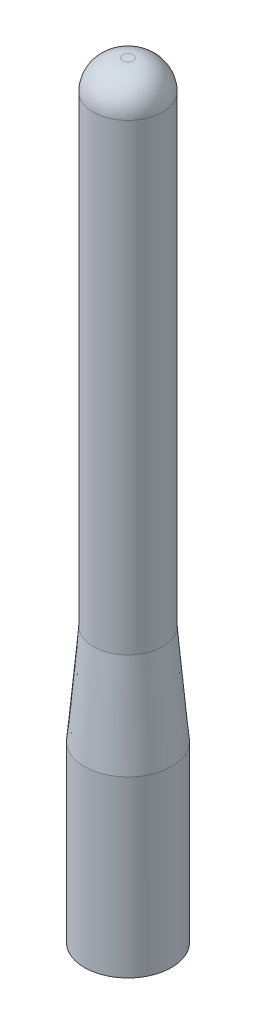
ISO-10303-21;
HEADER;
FILE_DESCRIPTION(('STEP AP214'),'2;1');
FILE_NAME('part.step','',(''),(''),'','','');
FILE_SCHEMA(('AUTOMOTIVE_DESIGN { 1 0 10303 214 1 1 1 1 }'));
ENDSEC;
DATA;
#1=APPLICATION_CONTEXT('core data for automotive mechanical design processes');
#2=APPLICATION_PROTOCOL_DEFINITION('international standard','automotive_design',2000,#1);
#3=PRODUCT_CONTEXT('',#1,'mechanical');
#4=PRODUCT('Part','Part','',(#3));
#5=PRODUCT_RELATED_PRODUCT_CATEGORY('part','',(#4));
#6=PRODUCT_DEFINITION_FORMATION('','',#4);
#7=PRODUCT_DEFINITION_CONTEXT('part definition',#1,'design');
#8=PRODUCT_DEFINITION('design','',#6,#7);
#9=PRODUCT_DEFINITION_SHAPE('','',#8);
#10=(LENGTH_UNIT() NAMED_UNIT(*) SI_UNIT(.MILLI.,.METRE.));
#11=(NAMED_UNIT(*) PLANE_ANGLE_UNIT() SI_UNIT($,.RADIAN.));
#12=(NAMED_UNIT(*) SI_UNIT($,.STERADIAN.) SOLID_ANGLE_UNIT());
#13=UNCERTAINTY_MEASURE_WITH_UNIT(LENGTH_MEASURE(1.E-05),#10,'distance_accuracy_value','');
#14=(GEOMETRIC_REPRESENTATION_CONTEXT(3) GLOBAL_UNCERTAINTY_ASSIGNED_CONTEXT((#13)) GLOBAL_UNIT_ASSIGNED_CONTEXT((#10,
#11,#12)) REPRESENTATION_CONTEXT('',''));
#15=CARTESIAN_POINT('',(0.,0.,0.));
#16=DIRECTION('',(0.,0.,1.));
#17=DIRECTION('',(1.,0.,0.));
#18=AXIS2_PLACEMENT_3D('',#15,#16,#17);
#19=CARTESIAN_POINT('',(0.,20.,0.));
#20=DIRECTION('',(0.,-1.,0.));
#21=DIRECTION('',(0.,0.,-1.));
#22=AXIS2_PLACEMENT_3D('',#19,#20,#21);
#23=CYLINDRICAL_SURFACE('',#22,5.);
#24=CARTESIAN_POINT('',(0.,20.,0.));
#25=DIRECTION('',(0.,1.,0.));
#26=DIRECTION('',(0.,0.,1.));
#27=AXIS2_PLACEMENT_3D('',#24,#25,#26);
#28=CIRCLE('',#27,5.);
#29=CARTESIAN_POINT('',(0.,20.,5.));
#30=VERTEX_POINT('',#29);
#31=EDGE_CURVE('E98',#30,#30,#28,.T.);
#32=ORIENTED_EDGE('',*,*,#31,.F.);
#33=EDGE_LOOP('',(#32));
#34=FACE_BOUND('',#33,.T.);
#35=CARTESIAN_POINT('',(0.,8.,0.));
#36=DIRECTION('',(0.,-1.,0.));
#37=DIRECTION('',(0.,0.,-1.));
#38=AXIS2_PLACEMENT_3D('',#35,#36,#37);
#39=CIRCLE('',#38,5.);
#40=CARTESIAN_POINT('',(-2.5,8.,-4.3301270189222));
#41=VERTEX_POINT('',#40);
#42=CARTESIAN_POINT('',(2.5,8.,-4.3301270189222));
#43=VERTEX_POINT('',#42);
#44=EDGE_CURVE('E94',#41,#43,#39,.T.);
#45=ORIENTED_EDGE('',*,*,#44,.F.);
#46=DIRECTION('',(0.,-1.,0.));
#47=VECTOR('',#46,1.);
#48=CARTESIAN_POINT('',(-2.5,20.,-4.3301270189222));
#49=LINE('',#48,#47);
#50=CARTESIAN_POINT('',(-2.5,0.,-4.3301270189222));
#51=VERTEX_POINT('',#50);
#52=EDGE_CURVE('E83',#41,#51,#49,.T.);
#53=ORIENTED_EDGE('',*,*,#52,.T.);
#54=CARTESIAN_POINT('',(0.,0.,0.));
#55=DIRECTION('',(0.,1.,0.));
#56=DIRECTION('',(0.,0.,1.));
#57=AXIS2_PLACEMENT_3D('',#54,#55,#56);
#58=CIRCLE('',#57,5.);
#59=CARTESIAN_POINT('',(2.5,0.,-4.3301270189222));
#60=VERTEX_POINT('',#59);
#61=EDGE_CURVE('E93',#51,#60,#58,.T.);
#62=ORIENTED_EDGE('',*,*,#61,.T.);
#63=DIRECTION('',(0.,-1.,0.));
#64=VECTOR('',#63,1.);
#65=CARTESIAN_POINT('',(2.5,20.,-4.3301270189222));
#66=LINE('',#65,#64);
#67=EDGE_CURVE('E95',#60,#43,#66,.F.);
#68=ORIENTED_EDGE('',*,*,#67,.T.);
#69=EDGE_LOOP('',(#45,#53,#62,#68));
#70=FACE_BOUND('',#69,.T.);
#71=ADVANCED_FACE('F35',(#34,#70),#23,.T.);
#72=CARTESIAN_POINT('',(0.,0.,0.));
#73=DIRECTION('',(0.,1.,0.));
#74=DIRECTION('',(0.,0.,1.));
#75=AXIS2_PLACEMENT_3D('',#72,#73,#74);
#76=PLANE('',#75);
#77=ORIENTED_EDGE('',*,*,#61,.F.);
#78=DIRECTION('',(0.,0.,-1.));
#79=VECTOR('',#78,1.);
#80=CARTESIAN_POINT('',(-2.5,0.,2.5));
#81=LINE('',#80,#79);
#82=CARTESIAN_POINT('',(-2.5,0.,2.5));
#83=VERTEX_POINT('',#82);
#84=EDGE_CURVE('E80',#83,#51,#81,.T.);
#85=ORIENTED_EDGE('',*,*,#84,.F.);
#86=DIRECTION('',(-1.,0.,0.));
#87=VECTOR('',#86,1.);
#88=CARTESIAN_POINT('',(2.5,0.,2.5));
#89=LINE('',#88,#87);
#90=CARTESIAN_POINT('',(2.5,0.,2.5));
#91=VERTEX_POINT('',#90);
#92=EDGE_CURVE('E123',#91,#83,#89,.T.);
#93=ORIENTED_EDGE('',*,*,#92,.F.);
#94=DIRECTION('',(0.,0.,1.));
#95=VECTOR('',#94,1.);
#96=CARTESIAN_POINT('',(2.5,0.,2.5));
#97=LINE('',#96,#95);
#98=EDGE_CURVE('E88',#60,#91,#97,.T.);
#99=ORIENTED_EDGE('',*,*,#98,.F.);
#100=EDGE_LOOP('',(#77,#85,#93,#99));
#101=FACE_BOUND('',#100,.T.);
#102=ADVANCED_FACE('F97',(#101),#76,.F.);
#103=CARTESIAN_POINT('',(0.,88.,0.));
#104=DIRECTION('',(0.,-1.,0.));
#105=DIRECTION('',(0.,0.,-1.));
#106=AXIS2_PLACEMENT_3D('',#103,#104,#105);
#107=CYLINDRICAL_SURFACE('',#106,4.);
#108=CARTESIAN_POINT('',(0.,31.430052302764,0.));
#109=DIRECTION('',(0.,1.,0.));
#110=DIRECTION('',(0.,0.,1.));
#111=AXIS2_PLACEMENT_3D('',#108,#109,#110);
#112=CIRCLE('',#111,4.);
#113=CARTESIAN_POINT('',(0.,31.430052302764,4.));
#114=VERTEX_POINT('',#113);
#115=EDGE_CURVE('E111',#114,#114,#112,.T.);
#116=ORIENTED_EDGE('',*,*,#115,.T.);
#117=EDGE_LOOP('',(#116));
#118=FACE_BOUND('',#117,.T.);
#119=CARTESIAN_POINT('',(0.,84.6,0.));
#120=DIRECTION('',(0.,1.,0.));
#121=DIRECTION('',(0.,0.,1.));
#122=AXIS2_PLACEMENT_3D('',#119,#120,#121);
#123=CIRCLE('',#122,4.);
#124=CARTESIAN_POINT('',(0.,84.6,4.));
#125=VERTEX_POINT('',#124);
#126=EDGE_CURVE('E108',#125,#125,#123,.F.);
#127=ORIENTED_EDGE('',*,*,#126,.T.);
#128=EDGE_LOOP('',(#127));
#129=FACE_BOUND('',#128,.T.);
#130=ADVANCED_FACE('F149',(#118,#129),#107,.T.);
#131=CARTESIAN_POINT('',(0.,88.,0.));
#132=DIRECTION('',(0.,1.,0.));
#133=DIRECTION('',(0.,0.,1.));
#134=AXIS2_PLACEMENT_3D('',#131,#132,#133);
#135=PLANE('',#134);
#136=CARTESIAN_POINT('',(0.,88.,0.));
#137=DIRECTION('',(0.,1.,0.));
#138=DIRECTION('',(0.,0.,1.));
#139=AXIS2_PLACEMENT_3D('',#136,#137,#138);
#140=CIRCLE('',#139,0.6);
#141=CARTESIAN_POINT('',(0.,88.,0.6));
#142=VERTEX_POINT('',#141);
#143=EDGE_CURVE('E101',#142,#142,#140,.T.);
#144=ORIENTED_EDGE('',*,*,#143,.T.);
#145=EDGE_LOOP('',(#144));
#146=FACE_BOUND('',#145,.T.);
#147=ADVANCED_FACE('F155',(#146),#135,.T.);
#148=CARTESIAN_POINT('',(0.,84.6,0.));
#149=DIRECTION('',(0.,1.,0.));
#150=DIRECTION('',(0.,0.,1.));
#151=AXIS2_PLACEMENT_3D('',#148,#149,#150);
#152=DEGENERATE_TOROIDAL_SURFACE('',#151,0.6,3.4,.T.);
#153=ORIENTED_EDGE('',*,*,#126,.F.);
#154=EDGE_LOOP('',(#153));
#155=FACE_BOUND('',#154,.T.);
#156=ORIENTED_EDGE('',*,*,#143,.F.);
#157=EDGE_LOOP('',(#156));
#158=FACE_BOUND('',#157,.T.);
#159=ADVANCED_FACE('F153',(#155,#158),#152,.T.);
#160=CARTESIAN_POINT('',(0.,31.430052302764,0.));
#161=DIRECTION('',(0.,-1.,0.));
#162=DIRECTION('',(0.,0.,-1.));
#163=AXIS2_PLACEMENT_3D('',#160,#161,#162);
#164=CONICAL_SURFACE('',#163,4.,0.0872664625997098);
#165=ORIENTED_EDGE('',*,*,#31,.T.);
#166=EDGE_LOOP('',(#165));
#167=FACE_BOUND('',#166,.T.);
#168=ORIENTED_EDGE('',*,*,#115,.F.);
#169=EDGE_LOOP('',(#168));
#170=FACE_BOUND('',#169,.T.);
#171=ADVANCED_FACE('F37',(#167,#170),#164,.T.);
#172=CARTESIAN_POINT('',(-2.5,8.,2.5));
#173=DIRECTION('',(-1.,0.,0.));
#174=DIRECTION('',(0.,0.,1.));
#175=AXIS2_PLACEMENT_3D('',#172,#173,#174);
#176=PLANE('',#175);
#177=CARTESIAN_POINT('',(-2.5,5.5,0.));
#178=DIRECTION('',(-1.,0.,0.));
#179=DIRECTION('',(0.,0.,1.));
#180=AXIS2_PLACEMENT_3D('',#177,#178,#179);
#181=CIRCLE('',#180,0.5);
#182=CARTESIAN_POINT('',(-2.5,5.5,0.5));
#183=VERTEX_POINT('',#182);
#184=EDGE_CURVE('E11',#183,#183,#181,.F.);
#185=ORIENTED_EDGE('',*,*,#184,.F.);
#186=EDGE_LOOP('',(#185));
#187=FACE_BOUND('',#186,.T.);
#188=ORIENTED_EDGE('',*,*,#84,.T.);
#189=ORIENTED_EDGE('',*,*,#52,.F.);
#190=DIRECTION('',(0.,0.,-1.));
#191=VECTOR('',#190,1.);
#192=CARTESIAN_POINT('',(-2.5,8.,2.5));
#193=LINE('',#192,#191);
#194=CARTESIAN_POINT('',(-2.5,8.,2.5));
#195=VERTEX_POINT('',#194);
#196=EDGE_CURVE('E125',#195,#41,#193,.T.);
#197=ORIENTED_EDGE('',*,*,#196,.F.);
#198=DIRECTION('',(0.,-1.,0.));
#199=VECTOR('',#198,1.);
#200=CARTESIAN_POINT('',(-2.5,8.,2.5));
#201=LINE('',#200,#199);
#202=EDGE_CURVE('E52',#195,#83,#201,.T.);
#203=ORIENTED_EDGE('',*,*,#202,.T.);
#204=EDGE_LOOP('',(#188,#189,#197,#203));
#205=FACE_BOUND('',#204,.T.);
#206=ADVANCED_FACE('F82',(#187,#205),#176,.F.);
#207=CARTESIAN_POINT('',(2.5,8.,2.5));
#208=DIRECTION('',(0.,0.,1.));
#209=DIRECTION('',(1.,0.,0.));
#210=AXIS2_PLACEMENT_3D('',#207,#208,#209);
#211=PLANE('',#210);
#212=ORIENTED_EDGE('',*,*,#92,.T.);
#213=ORIENTED_EDGE('',*,*,#202,.F.);
#214=DIRECTION('',(-1.,0.,0.));
#215=VECTOR('',#214,1.);
#216=CARTESIAN_POINT('',(2.5,8.,2.5));
#217=LINE('',#216,#215);
#218=CARTESIAN_POINT('',(2.5,8.,2.5));
#219=VERTEX_POINT('',#218);
#220=EDGE_CURVE('E128',#219,#195,#217,.T.);
#221=ORIENTED_EDGE('',*,*,#220,.F.);
#222=DIRECTION('',(0.,-1.,0.));
#223=VECTOR('',#222,1.);
#224=CARTESIAN_POINT('',(2.5,8.,2.5));
#225=LINE('',#224,#223);
#226=EDGE_CURVE('E60',#219,#91,#225,.T.);
#227=ORIENTED_EDGE('',*,*,#226,.T.);
#228=EDGE_LOOP('',(#212,#213,#221,#227));
#229=FACE_BOUND('',#228,.T.);
#230=ADVANCED_FACE('F121',(#229),#211,.F.);
#231=CARTESIAN_POINT('',(2.5,8.,2.5));
#232=DIRECTION('',(1.,0.,0.));
#233=DIRECTION('',(0.,0.,-1.));
#234=AXIS2_PLACEMENT_3D('',#231,#232,#233);
#235=PLANE('',#234);
#236=CARTESIAN_POINT('',(2.5,5.5,0.));
#237=DIRECTION('',(1.,0.,0.));
#238=DIRECTION('',(0.,0.,-1.));
#239=AXIS2_PLACEMENT_3D('',#236,#237,#238);
#240=CIRCLE('',#239,0.5);
#241=CARTESIAN_POINT('',(2.5,5.5,-0.5));
#242=VERTEX_POINT('',#241);
#243=EDGE_CURVE('E44',#242,#242,#240,.F.);
#244=ORIENTED_EDGE('',*,*,#243,.F.);
#245=EDGE_LOOP('',(#244));
#246=FACE_BOUND('',#245,.T.);
#247=ORIENTED_EDGE('',*,*,#98,.T.);
#248=ORIENTED_EDGE('',*,*,#226,.F.);
#249=DIRECTION('',(0.,0.,1.));
#250=VECTOR('',#249,1.);
#251=CARTESIAN_POINT('',(2.5,8.,2.5));
#252=LINE('',#251,#250);
#253=EDGE_CURVE('E67',#43,#219,#252,.T.);
#254=ORIENTED_EDGE('',*,*,#253,.F.);
#255=ORIENTED_EDGE('',*,*,#67,.F.);
#256=EDGE_LOOP('',(#247,#248,#254,#255));
#257=FACE_BOUND('',#256,.T.);
#258=ADVANCED_FACE('F118',(#246,#257),#235,.F.);
#259=CARTESIAN_POINT('',(0.,8.,0.));
#260=DIRECTION('',(0.,1.,0.));
#261=DIRECTION('',(0.,0.,1.));
#262=AXIS2_PLACEMENT_3D('',#259,#260,#261);
#263=PLANE('',#262);
#264=ORIENTED_EDGE('',*,*,#196,.T.);
#265=ORIENTED_EDGE('',*,*,#44,.T.);
#266=ORIENTED_EDGE('',*,*,#253,.T.);
#267=ORIENTED_EDGE('',*,*,#220,.T.);
#268=EDGE_LOOP('',(#264,#265,#266,#267));
#269=FACE_BOUND('',#268,.T.);
#270=ADVANCED_FACE('F120',(#269),#263,.F.);
#271=CARTESIAN_POINT('',(-2.5,5.5,0.));
#272=DIRECTION('',(1.,0.,0.));
#273=DIRECTION('',(0.,0.,-1.));
#274=AXIS2_PLACEMENT_3D('',#271,#272,#273);
#275=CYLINDRICAL_SURFACE('',#274,0.5);
#276=ORIENTED_EDGE('',*,*,#184,.T.);
#277=EDGE_LOOP('',(#276));
#278=FACE_BOUND('',#277,.T.);
#279=ORIENTED_EDGE('',*,*,#243,.T.);
#280=EDGE_LOOP('',(#279));
#281=FACE_BOUND('',#280,.T.);
#282=ADVANCED_FACE('F116',(#278,#281),#275,.T.);
#283=CLOSED_SHELL('',(#71,#102,#130,#147,#159,#171,#206,#230,#258,#270,#282));
#284=MANIFOLD_SOLID_BREP('B2',#283);
#285=ADVANCED_BREP_SHAPE_REPRESENTATION('',(#18,#284),#14);
#286=SHAPE_DEFINITION_REPRESENTATION(#9,#285);
ENDSEC;
END-ISO-10303-21;
